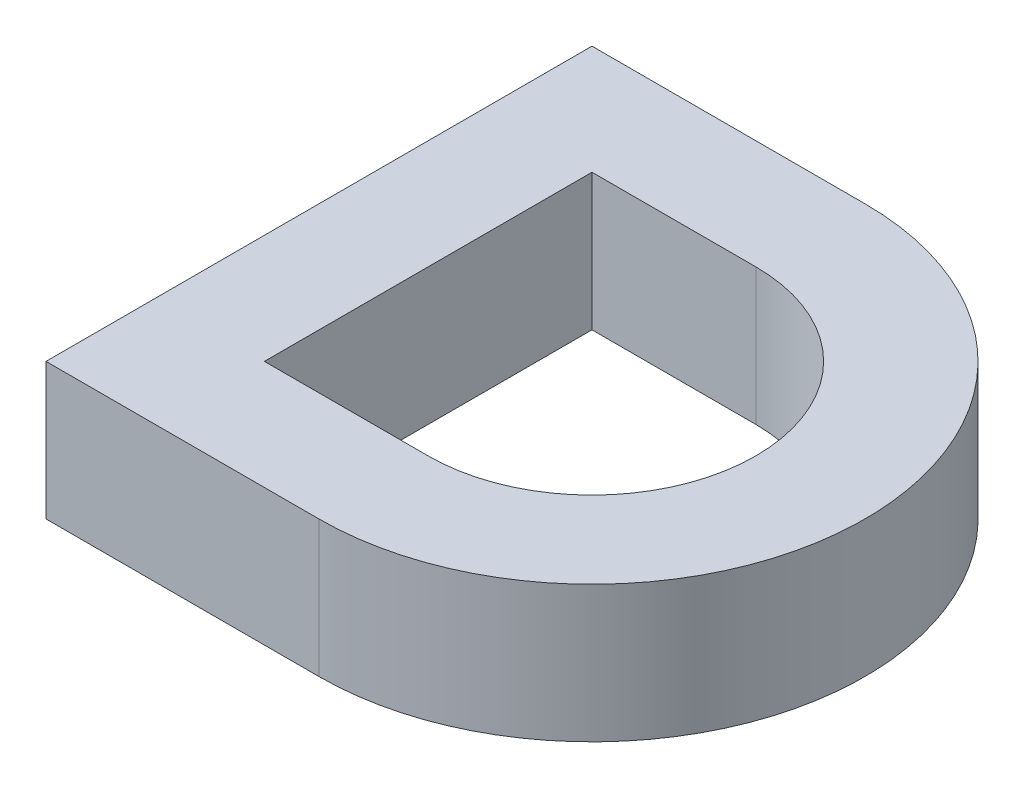
ISO-10303-21;
HEADER;
FILE_DESCRIPTION(('STEP AP214'),'2;1');
FILE_NAME('part.step','',(''),(''),'','','');
FILE_SCHEMA(('AUTOMOTIVE_DESIGN { 1 0 10303 214 1 1 1 1 }'));
ENDSEC;
DATA;
#1=APPLICATION_CONTEXT('core data for automotive mechanical design processes');
#2=APPLICATION_PROTOCOL_DEFINITION('international standard','automotive_design',2000,#1);
#3=PRODUCT_CONTEXT('',#1,'mechanical');
#4=PRODUCT('Part','Part','',(#3));
#5=PRODUCT_RELATED_PRODUCT_CATEGORY('part','',(#4));
#6=PRODUCT_DEFINITION_FORMATION('','',#4);
#7=PRODUCT_DEFINITION_CONTEXT('part definition',#1,'design');
#8=PRODUCT_DEFINITION('design','',#6,#7);
#9=PRODUCT_DEFINITION_SHAPE('','',#8);
#10=(LENGTH_UNIT() NAMED_UNIT(*) SI_UNIT(.MILLI.,.METRE.));
#11=(NAMED_UNIT(*) PLANE_ANGLE_UNIT() SI_UNIT($,.RADIAN.));
#12=(NAMED_UNIT(*) SI_UNIT($,.STERADIAN.) SOLID_ANGLE_UNIT());
#13=UNCERTAINTY_MEASURE_WITH_UNIT(LENGTH_MEASURE(1.E-05),#10,'distance_accuracy_value','');
#14=(GEOMETRIC_REPRESENTATION_CONTEXT(3) GLOBAL_UNCERTAINTY_ASSIGNED_CONTEXT((#13)) GLOBAL_UNIT_ASSIGNED_CONTEXT((#10,
#11,#12)) REPRESENTATION_CONTEXT('',''));
#15=CARTESIAN_POINT('',(0.,0.,0.));
#16=DIRECTION('',(0.,0.,1.));
#17=DIRECTION('',(1.,0.,0.));
#18=AXIS2_PLACEMENT_3D('',#15,#16,#17);
#19=CARTESIAN_POINT('',(170.,10.,-20.));
#20=DIRECTION('',(0.,-1.,0.));
#21=DIRECTION('',(0.,0.,-1.));
#22=AXIS2_PLACEMENT_3D('',#19,#20,#21);
#23=PLANE('',#22);
#24=DIRECTION('',(1.,0.,0.));
#25=VECTOR('',#24,1.);
#26=CARTESIAN_POINT('',(170.,10.,0.));
#27=LINE('',#26,#25);
#28=CARTESIAN_POINT('',(150.,10.,0.));
#29=VERTEX_POINT('',#28);
#30=CARTESIAN_POINT('',(170.,10.,0.));
#31=VERTEX_POINT('',#30);
#32=EDGE_CURVE('E134',#29,#31,#27,.T.);
#33=ORIENTED_EDGE('',*,*,#32,.T.);
#34=CARTESIAN_POINT('',(170.,10.,-20.));
#35=DIRECTION('',(0.,1.,0.));
#36=DIRECTION('',(0.,0.,-1.));
#37=AXIS2_PLACEMENT_3D('',#34,#35,#36);
#38=CIRCLE('',#37,20.);
#39=CARTESIAN_POINT('',(170.,10.,-40.));
#40=VERTEX_POINT('',#39);
#41=EDGE_CURVE('E137',#31,#40,#38,.T.);
#42=ORIENTED_EDGE('',*,*,#41,.T.);
#43=DIRECTION('',(-1.,0.,0.));
#44=VECTOR('',#43,1.);
#45=CARTESIAN_POINT('',(150.,10.,-40.));
#46=LINE('',#45,#44);
#47=CARTESIAN_POINT('',(150.,10.,-40.));
#48=VERTEX_POINT('',#47);
#49=EDGE_CURVE('E140',#40,#48,#46,.T.);
#50=ORIENTED_EDGE('',*,*,#49,.T.);
#51=DIRECTION('',(0.,0.,1.));
#52=VECTOR('',#51,1.);
#53=CARTESIAN_POINT('',(150.,10.,0.));
#54=LINE('',#53,#52);
#55=EDGE_CURVE('E142',#48,#29,#54,.T.);
#56=ORIENTED_EDGE('',*,*,#55,.T.);
#57=EDGE_LOOP('',(#33,#42,#50,#56));
#58=FACE_BOUND('',#57,.T.);
#59=CARTESIAN_POINT('',(170.,10.,-20.));
#60=DIRECTION('',(0.,1.,0.));
#61=DIRECTION('',(0.,0.,1.));
#62=AXIS2_PLACEMENT_3D('',#59,#60,#61);
#63=CIRCLE('',#62,12.);
#64=CARTESIAN_POINT('',(170.,10.,-8.));
#65=VERTEX_POINT('',#64);
#66=CARTESIAN_POINT('',(170.,10.,-32.));
#67=VERTEX_POINT('',#66);
#68=EDGE_CURVE('E98',#65,#67,#63,.T.);
#69=ORIENTED_EDGE('',*,*,#68,.F.);
#70=DIRECTION('',(1.,0.,0.));
#71=VECTOR('',#70,1.);
#72=CARTESIAN_POINT('',(158.,10.,-8.));
#73=LINE('',#72,#71);
#74=CARTESIAN_POINT('',(158.,10.,-8.));
#75=VERTEX_POINT('',#74);
#76=EDGE_CURVE('E120',#75,#65,#73,.T.);
#77=ORIENTED_EDGE('',*,*,#76,.F.);
#78=DIRECTION('',(0.,0.,1.));
#79=VECTOR('',#78,1.);
#80=CARTESIAN_POINT('',(158.,10.,-32.));
#81=LINE('',#80,#79);
#82=CARTESIAN_POINT('',(158.,10.,-32.));
#83=VERTEX_POINT('',#82);
#84=EDGE_CURVE('E118',#83,#75,#81,.T.);
#85=ORIENTED_EDGE('',*,*,#84,.F.);
#86=DIRECTION('',(-1.,0.,0.));
#87=VECTOR('',#86,1.);
#88=CARTESIAN_POINT('',(170.,10.,-32.));
#89=LINE('',#88,#87);
#90=EDGE_CURVE('E106',#67,#83,#89,.T.);
#91=ORIENTED_EDGE('',*,*,#90,.F.);
#92=EDGE_LOOP('',(#69,#77,#85,#91));
#93=FACE_BOUND('',#92,.T.);
#94=ADVANCED_FACE('F33',(#58,#93),#23,.F.);
#95=CARTESIAN_POINT('',(170.,0.,-20.));
#96=DIRECTION('',(0.,-1.,0.));
#97=DIRECTION('',(0.,0.,-1.));
#98=AXIS2_PLACEMENT_3D('',#95,#96,#97);
#99=PLANE('',#98);
#100=DIRECTION('',(1.,0.,0.));
#101=VECTOR('',#100,1.);
#102=CARTESIAN_POINT('',(170.,0.,0.));
#103=LINE('',#102,#101);
#104=CARTESIAN_POINT('',(150.,0.,0.));
#105=VERTEX_POINT('',#104);
#106=CARTESIAN_POINT('',(170.,0.,0.));
#107=VERTEX_POINT('',#106);
#108=EDGE_CURVE('E114',#105,#107,#103,.T.);
#109=ORIENTED_EDGE('',*,*,#108,.F.);
#110=DIRECTION('',(0.,0.,1.));
#111=VECTOR('',#110,1.);
#112=CARTESIAN_POINT('',(150.,0.,0.));
#113=LINE('',#112,#111);
#114=CARTESIAN_POINT('',(150.,0.,-40.));
#115=VERTEX_POINT('',#114);
#116=EDGE_CURVE('E138',#115,#105,#113,.T.);
#117=ORIENTED_EDGE('',*,*,#116,.F.);
#118=DIRECTION('',(-1.,0.,0.));
#119=VECTOR('',#118,1.);
#120=CARTESIAN_POINT('',(150.,0.,-40.));
#121=LINE('',#120,#119);
#122=CARTESIAN_POINT('',(170.,0.,-40.));
#123=VERTEX_POINT('',#122);
#124=EDGE_CURVE('E149',#123,#115,#121,.T.);
#125=ORIENTED_EDGE('',*,*,#124,.F.);
#126=CARTESIAN_POINT('',(170.,0.,-20.));
#127=DIRECTION('',(0.,1.,0.));
#128=DIRECTION('',(0.,0.,-1.));
#129=AXIS2_PLACEMENT_3D('',#126,#127,#128);
#130=CIRCLE('',#129,20.);
#131=EDGE_CURVE('E147',#107,#123,#130,.T.);
#132=ORIENTED_EDGE('',*,*,#131,.F.);
#133=EDGE_LOOP('',(#109,#117,#125,#132));
#134=FACE_BOUND('',#133,.T.);
#135=DIRECTION('',(1.,0.,0.));
#136=VECTOR('',#135,1.);
#137=CARTESIAN_POINT('',(158.,0.,-8.));
#138=LINE('',#137,#136);
#139=CARTESIAN_POINT('',(158.,0.,-8.));
#140=VERTEX_POINT('',#139);
#141=CARTESIAN_POINT('',(170.,0.,-8.));
#142=VERTEX_POINT('',#141);
#143=EDGE_CURVE('E107',#140,#142,#138,.T.);
#144=ORIENTED_EDGE('',*,*,#143,.T.);
#145=CARTESIAN_POINT('',(170.,0.,-20.));
#146=DIRECTION('',(0.,1.,0.));
#147=DIRECTION('',(0.,0.,1.));
#148=AXIS2_PLACEMENT_3D('',#145,#146,#147);
#149=CIRCLE('',#148,12.);
#150=CARTESIAN_POINT('',(170.,0.,-32.));
#151=VERTEX_POINT('',#150);
#152=EDGE_CURVE('E56',#142,#151,#149,.T.);
#153=ORIENTED_EDGE('',*,*,#152,.T.);
#154=DIRECTION('',(-1.,0.,0.));
#155=VECTOR('',#154,1.);
#156=CARTESIAN_POINT('',(170.,0.,-32.));
#157=LINE('',#156,#155);
#158=CARTESIAN_POINT('',(158.,0.,-32.));
#159=VERTEX_POINT('',#158);
#160=EDGE_CURVE('E113',#151,#159,#157,.T.);
#161=ORIENTED_EDGE('',*,*,#160,.T.);
#162=DIRECTION('',(0.,0.,1.));
#163=VECTOR('',#162,1.);
#164=CARTESIAN_POINT('',(158.,0.,-32.));
#165=LINE('',#164,#163);
#166=EDGE_CURVE('E126',#159,#140,#165,.T.);
#167=ORIENTED_EDGE('',*,*,#166,.T.);
#168=EDGE_LOOP('',(#144,#153,#161,#167));
#169=FACE_BOUND('',#168,.T.);
#170=ADVANCED_FACE('F167',(#134,#169),#99,.T.);
#171=CARTESIAN_POINT('',(170.,10.,0.));
#172=DIRECTION('',(0.,0.,-1.));
#173=DIRECTION('',(-1.,0.,0.));
#174=AXIS2_PLACEMENT_3D('',#171,#172,#173);
#175=PLANE('',#174);
#176=ORIENTED_EDGE('',*,*,#108,.T.);
#177=DIRECTION('',(0.,-1.,0.));
#178=VECTOR('',#177,1.);
#179=CARTESIAN_POINT('',(170.,10.,0.));
#180=LINE('',#179,#178);
#181=EDGE_CURVE('E11',#31,#107,#180,.T.);
#182=ORIENTED_EDGE('',*,*,#181,.F.);
#183=ORIENTED_EDGE('',*,*,#32,.F.);
#184=DIRECTION('',(0.,-1.,0.));
#185=VECTOR('',#184,1.);
#186=CARTESIAN_POINT('',(150.,10.,0.));
#187=LINE('',#186,#185);
#188=EDGE_CURVE('E144',#29,#105,#187,.T.);
#189=ORIENTED_EDGE('',*,*,#188,.T.);
#190=EDGE_LOOP('',(#176,#182,#183,#189));
#191=FACE_BOUND('',#190,.T.);
#192=ADVANCED_FACE('F35',(#191),#175,.F.);
#193=CARTESIAN_POINT('',(170.,10.,-20.));
#194=DIRECTION('',(0.,-1.,0.));
#195=DIRECTION('',(0.,0.,-1.));
#196=AXIS2_PLACEMENT_3D('',#193,#194,#195);
#197=CYLINDRICAL_SURFACE('',#196,20.);
#198=ORIENTED_EDGE('',*,*,#131,.T.);
#199=DIRECTION('',(0.,-1.,0.));
#200=VECTOR('',#199,1.);
#201=CARTESIAN_POINT('',(170.,10.,-40.));
#202=LINE('',#201,#200);
#203=EDGE_CURVE('E41',#40,#123,#202,.T.);
#204=ORIENTED_EDGE('',*,*,#203,.F.);
#205=ORIENTED_EDGE('',*,*,#41,.F.);
#206=ORIENTED_EDGE('',*,*,#181,.T.);
#207=EDGE_LOOP('',(#198,#204,#205,#206));
#208=FACE_BOUND('',#207,.T.);
#209=ADVANCED_FACE('F177',(#208),#197,.T.);
#210=CARTESIAN_POINT('',(150.,10.,-40.));
#211=DIRECTION('',(0.,0.,1.));
#212=DIRECTION('',(1.,0.,0.));
#213=AXIS2_PLACEMENT_3D('',#210,#211,#212);
#214=PLANE('',#213);
#215=ORIENTED_EDGE('',*,*,#124,.T.);
#216=DIRECTION('',(0.,-1.,0.));
#217=VECTOR('',#216,1.);
#218=CARTESIAN_POINT('',(150.,10.,-40.));
#219=LINE('',#218,#217);
#220=EDGE_CURVE('E154',#48,#115,#219,.T.);
#221=ORIENTED_EDGE('',*,*,#220,.F.);
#222=ORIENTED_EDGE('',*,*,#49,.F.);
#223=ORIENTED_EDGE('',*,*,#203,.T.);
#224=EDGE_LOOP('',(#215,#221,#222,#223));
#225=FACE_BOUND('',#224,.T.);
#226=ADVANCED_FACE('F161',(#225),#214,.F.);
#227=CARTESIAN_POINT('',(150.,10.,0.));
#228=DIRECTION('',(1.,0.,0.));
#229=DIRECTION('',(0.,0.,-1.));
#230=AXIS2_PLACEMENT_3D('',#227,#228,#229);
#231=PLANE('',#230);
#232=ORIENTED_EDGE('',*,*,#116,.T.);
#233=ORIENTED_EDGE('',*,*,#188,.F.);
#234=ORIENTED_EDGE('',*,*,#55,.F.);
#235=ORIENTED_EDGE('',*,*,#220,.T.);
#236=EDGE_LOOP('',(#232,#233,#234,#235));
#237=FACE_BOUND('',#236,.T.);
#238=ADVANCED_FACE('F171',(#237),#231,.F.);
#239=CARTESIAN_POINT('',(170.,10.,-20.));
#240=DIRECTION('',(0.,-1.,0.));
#241=DIRECTION('',(0.,0.,-1.));
#242=AXIS2_PLACEMENT_3D('',#239,#240,#241);
#243=CYLINDRICAL_SURFACE('',#242,12.);
#244=ORIENTED_EDGE('',*,*,#152,.F.);
#245=DIRECTION('',(0.,-1.,0.));
#246=VECTOR('',#245,1.);
#247=CARTESIAN_POINT('',(170.,10.,-8.));
#248=LINE('',#247,#246);
#249=EDGE_CURVE('E102',#65,#142,#248,.T.);
#250=ORIENTED_EDGE('',*,*,#249,.F.);
#251=ORIENTED_EDGE('',*,*,#68,.T.);
#252=DIRECTION('',(0.,-1.,0.));
#253=VECTOR('',#252,1.);
#254=CARTESIAN_POINT('',(170.,10.,-32.));
#255=LINE('',#254,#253);
#256=EDGE_CURVE('E101',#67,#151,#255,.T.);
#257=ORIENTED_EDGE('',*,*,#256,.T.);
#258=EDGE_LOOP('',(#244,#250,#251,#257));
#259=FACE_BOUND('',#258,.T.);
#260=ADVANCED_FACE('F100',(#259),#243,.F.);
#261=CARTESIAN_POINT('',(170.,10.,-32.));
#262=DIRECTION('',(0.,0.,1.));
#263=DIRECTION('',(1.,0.,0.));
#264=AXIS2_PLACEMENT_3D('',#261,#262,#263);
#265=PLANE('',#264);
#266=ORIENTED_EDGE('',*,*,#160,.F.);
#267=ORIENTED_EDGE('',*,*,#256,.F.);
#268=ORIENTED_EDGE('',*,*,#90,.T.);
#269=DIRECTION('',(0.,-1.,0.));
#270=VECTOR('',#269,1.);
#271=CARTESIAN_POINT('',(158.,10.,-32.));
#272=LINE('',#271,#270);
#273=EDGE_CURVE('E115',#83,#159,#272,.T.);
#274=ORIENTED_EDGE('',*,*,#273,.T.);
#275=EDGE_LOOP('',(#266,#267,#268,#274));
#276=FACE_BOUND('',#275,.T.);
#277=ADVANCED_FACE('F110',(#276),#265,.T.);
#278=CARTESIAN_POINT('',(158.,10.,-32.));
#279=DIRECTION('',(1.,0.,0.));
#280=DIRECTION('',(0.,0.,-1.));
#281=AXIS2_PLACEMENT_3D('',#278,#279,#280);
#282=PLANE('',#281);
#283=ORIENTED_EDGE('',*,*,#166,.F.);
#284=ORIENTED_EDGE('',*,*,#273,.F.);
#285=ORIENTED_EDGE('',*,*,#84,.T.);
#286=DIRECTION('',(0.,-1.,0.));
#287=VECTOR('',#286,1.);
#288=CARTESIAN_POINT('',(158.,10.,-8.));
#289=LINE('',#288,#287);
#290=EDGE_CURVE('E48',#75,#140,#289,.T.);
#291=ORIENTED_EDGE('',*,*,#290,.T.);
#292=EDGE_LOOP('',(#283,#284,#285,#291));
#293=FACE_BOUND('',#292,.T.);
#294=ADVANCED_FACE('F200',(#293),#282,.T.);
#295=CARTESIAN_POINT('',(158.,10.,-8.));
#296=DIRECTION('',(0.,0.,-1.));
#297=DIRECTION('',(-1.,0.,0.));
#298=AXIS2_PLACEMENT_3D('',#295,#296,#297);
#299=PLANE('',#298);
#300=ORIENTED_EDGE('',*,*,#143,.F.);
#301=ORIENTED_EDGE('',*,*,#290,.F.);
#302=ORIENTED_EDGE('',*,*,#76,.T.);
#303=ORIENTED_EDGE('',*,*,#249,.T.);
#304=EDGE_LOOP('',(#300,#301,#302,#303));
#305=FACE_BOUND('',#304,.T.);
#306=ADVANCED_FACE('F204',(#305),#299,.T.);
#307=CLOSED_SHELL('',(#94,#170,#192,#209,#226,#238,#260,#277,#294,#306));
#308=MANIFOLD_SOLID_BREP('B2',#307);
#309=ADVANCED_BREP_SHAPE_REPRESENTATION('',(#18,#308),#14);
#310=SHAPE_DEFINITION_REPRESENTATION(#9,#309);
ENDSEC;
END-ISO-10303-21;
